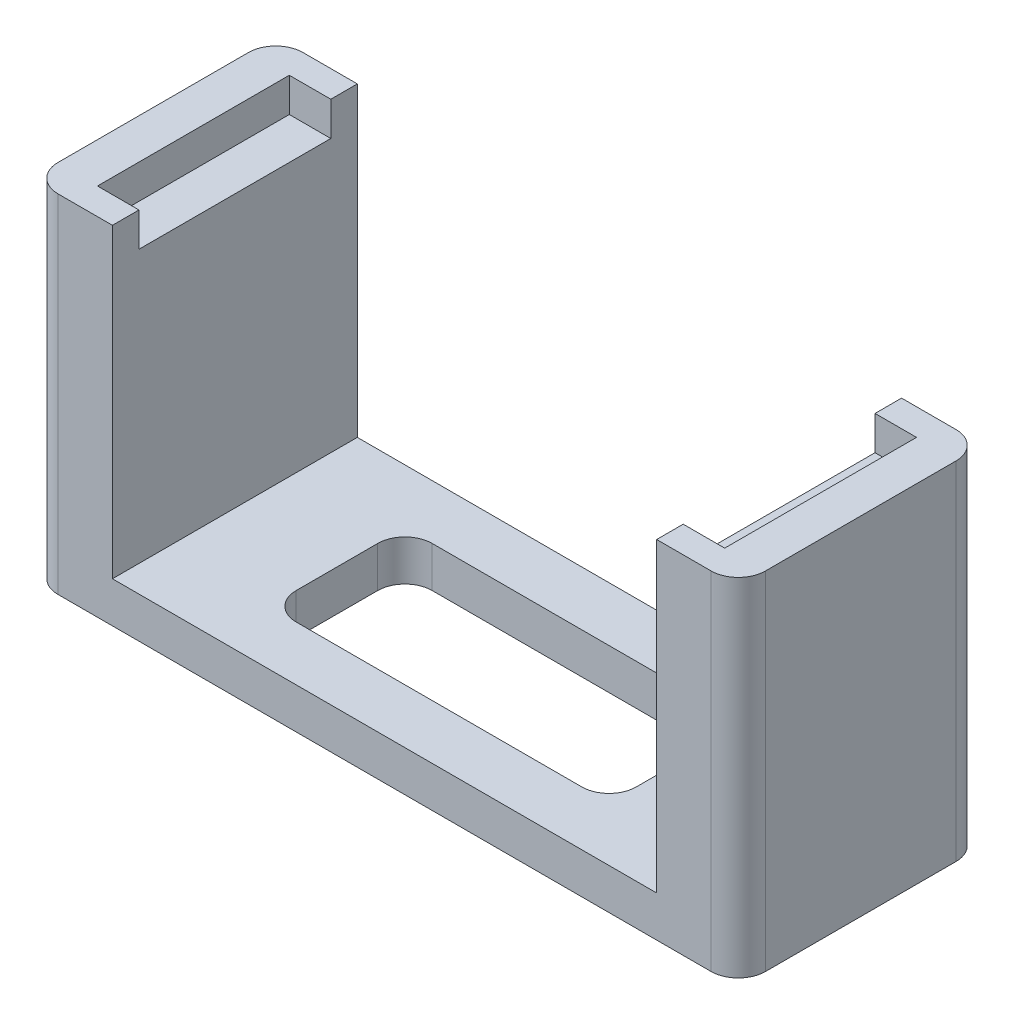
ISO-10303-21;
HEADER;
FILE_DESCRIPTION(('STEP AP214'),'2;1');
FILE_NAME('part.step','',(''),(''),'','','');
FILE_SCHEMA(('AUTOMOTIVE_DESIGN { 1 0 10303 214 1 1 1 1 }'));
ENDSEC;
DATA;
#1=APPLICATION_CONTEXT('core data for automotive mechanical design processes');
#2=APPLICATION_PROTOCOL_DEFINITION('international standard','automotive_design',2000,#1);
#3=PRODUCT_CONTEXT('',#1,'mechanical');
#4=PRODUCT('Part','Part','',(#3));
#5=PRODUCT_RELATED_PRODUCT_CATEGORY('part','',(#4));
#6=PRODUCT_DEFINITION_FORMATION('','',#4);
#7=PRODUCT_DEFINITION_CONTEXT('part definition',#1,'design');
#8=PRODUCT_DEFINITION('design','',#6,#7);
#9=PRODUCT_DEFINITION_SHAPE('','',#8);
#10=(LENGTH_UNIT() NAMED_UNIT(*) SI_UNIT(.MILLI.,.METRE.));
#11=(NAMED_UNIT(*) PLANE_ANGLE_UNIT() SI_UNIT($,.RADIAN.));
#12=(NAMED_UNIT(*) SI_UNIT($,.STERADIAN.) SOLID_ANGLE_UNIT());
#13=UNCERTAINTY_MEASURE_WITH_UNIT(LENGTH_MEASURE(1.E-05),#10,'distance_accuracy_value','');
#14=(GEOMETRIC_REPRESENTATION_CONTEXT(3) GLOBAL_UNCERTAINTY_ASSIGNED_CONTEXT((#13)) GLOBAL_UNIT_ASSIGNED_CONTEXT((#10,
#11,#12)) REPRESENTATION_CONTEXT('',''));
#15=CARTESIAN_POINT('',(0.,0.,0.));
#16=DIRECTION('',(0.,0.,1.));
#17=DIRECTION('',(1.,0.,0.));
#18=AXIS2_PLACEMENT_3D('',#15,#16,#17);
#19=CARTESIAN_POINT('',(0.,25.5,0.));
#20=DIRECTION('',(0.,1.,0.));
#21=DIRECTION('',(0.,0.,1.));
#22=AXIS2_PLACEMENT_3D('',#19,#20,#21);
#23=PLANE('',#22);
#24=DIRECTION('',(0.,0.,1.));
#25=VECTOR('',#24,1.);
#26=CARTESIAN_POINT('',(-26.,25.5,-9.));
#27=LINE('',#26,#25);
#28=CARTESIAN_POINT('',(-26.,25.5,-7.));
#29=VERTEX_POINT('',#28);
#30=CARTESIAN_POINT('',(-26.,25.5,7.));
#31=VERTEX_POINT('',#30);
#32=EDGE_CURVE('E339',#29,#31,#27,.T.);
#33=ORIENTED_EDGE('',*,*,#32,.T.);
#34=CARTESIAN_POINT('',(-24.,25.5,7.));
#35=DIRECTION('',(0.,1.,0.));
#36=DIRECTION('',(0.,0.,1.));
#37=AXIS2_PLACEMENT_3D('',#34,#35,#36);
#38=CIRCLE('',#37,2.);
#39=CARTESIAN_POINT('',(-24.,25.5,9.));
#40=VERTEX_POINT('',#39);
#41=EDGE_CURVE('E236',#31,#40,#38,.T.);
#42=ORIENTED_EDGE('',*,*,#41,.T.);
#43=DIRECTION('',(1.,0.,0.));
#44=VECTOR('',#43,1.);
#45=CARTESIAN_POINT('',(-26.,25.5,9.));
#46=LINE('',#45,#44);
#47=CARTESIAN_POINT('',(-20.,25.5,9.));
#48=VERTEX_POINT('',#47);
#49=EDGE_CURVE('E229',#40,#48,#46,.T.);
#50=ORIENTED_EDGE('',*,*,#49,.T.);
#51=DIRECTION('',(0.,0.,1.));
#52=VECTOR('',#51,1.);
#53=CARTESIAN_POINT('',(-20.,25.5,-9.));
#54=LINE('',#53,#52);
#55=CARTESIAN_POINT('',(-20.,25.5,7.05));
#56=VERTEX_POINT('',#55);
#57=EDGE_CURVE('E233',#56,#48,#54,.T.);
#58=ORIENTED_EDGE('',*,*,#57,.F.);
#59=DIRECTION('',(1.,0.,0.));
#60=VECTOR('',#59,1.);
#61=CARTESIAN_POINT('',(-23.05,25.5,7.05));
#62=LINE('',#61,#60);
#63=CARTESIAN_POINT('',(-23.05,25.5,7.05));
#64=VERTEX_POINT('',#63);
#65=EDGE_CURVE('E313',#64,#56,#62,.T.);
#66=ORIENTED_EDGE('',*,*,#65,.F.);
#67=DIRECTION('',(0.,0.,1.));
#68=VECTOR('',#67,1.);
#69=CARTESIAN_POINT('',(-23.05,25.5,-7.05));
#70=LINE('',#69,#68);
#71=CARTESIAN_POINT('',(-23.05,25.5,-7.05));
#72=VERTEX_POINT('',#71);
#73=EDGE_CURVE('E289',#72,#64,#70,.T.);
#74=ORIENTED_EDGE('',*,*,#73,.F.);
#75=DIRECTION('',(-1.,0.,0.));
#76=VECTOR('',#75,1.);
#77=CARTESIAN_POINT('',(-23.05,25.5,-7.05));
#78=LINE('',#77,#76);
#79=CARTESIAN_POINT('',(-20.,25.5,-7.05));
#80=VERTEX_POINT('',#79);
#81=EDGE_CURVE('E320',#80,#72,#78,.T.);
#82=ORIENTED_EDGE('',*,*,#81,.F.);
#83=CARTESIAN_POINT('',(-20.,25.5,-9.));
#84=VERTEX_POINT('',#83);
#85=EDGE_CURVE('E253',#84,#80,#54,.T.);
#86=ORIENTED_EDGE('',*,*,#85,.F.);
#87=DIRECTION('',(-1.,0.,0.));
#88=VECTOR('',#87,1.);
#89=CARTESIAN_POINT('',(-26.,25.5,-9.));
#90=LINE('',#89,#88);
#91=CARTESIAN_POINT('',(-24.,25.5,-9.));
#92=VERTEX_POINT('',#91);
#93=EDGE_CURVE('E346',#84,#92,#90,.T.);
#94=ORIENTED_EDGE('',*,*,#93,.T.);
#95=CARTESIAN_POINT('',(-24.,25.5,-7.));
#96=DIRECTION('',(0.,1.,0.));
#97=DIRECTION('',(0.,0.,1.));
#98=AXIS2_PLACEMENT_3D('',#95,#96,#97);
#99=CIRCLE('',#98,2.);
#100=EDGE_CURVE('E395',#92,#29,#99,.T.);
#101=ORIENTED_EDGE('',*,*,#100,.T.);
#102=EDGE_LOOP('',(#33,#42,#50,#58,#66,#74,#82,#86,#94,#101));
#103=FACE_BOUND('',#102,.T.);
#104=ADVANCED_FACE('F43',(#103),#23,.T.);
#105=CARTESIAN_POINT('',(-23.05,23.,-7.05));
#106=DIRECTION('',(0.,0.,-1.));
#107=DIRECTION('',(-1.,0.,0.));
#108=AXIS2_PLACEMENT_3D('',#105,#106,#107);
#109=PLANE('',#108);
#110=DIRECTION('',(-1.,0.,0.));
#111=VECTOR('',#110,1.);
#112=CARTESIAN_POINT('',(-23.05,23.,-7.05));
#113=LINE('',#112,#111);
#114=CARTESIAN_POINT('',(-20.,23.,-7.05));
#115=VERTEX_POINT('',#114);
#116=CARTESIAN_POINT('',(-23.05,23.,-7.05));
#117=VERTEX_POINT('',#116);
#118=EDGE_CURVE('E304',#115,#117,#113,.T.);
#119=ORIENTED_EDGE('',*,*,#118,.F.);
#120=DIRECTION('',(0.,1.,0.));
#121=VECTOR('',#120,1.);
#122=CARTESIAN_POINT('',(-20.,23.,-7.05));
#123=LINE('',#122,#121);
#124=EDGE_CURVE('E285',#115,#80,#123,.T.);
#125=ORIENTED_EDGE('',*,*,#124,.T.);
#126=ORIENTED_EDGE('',*,*,#81,.T.);
#127=DIRECTION('',(0.,1.,0.));
#128=VECTOR('',#127,1.);
#129=CARTESIAN_POINT('',(-23.05,23.,-7.05));
#130=LINE('',#129,#128);
#131=EDGE_CURVE('E324',#117,#72,#130,.T.);
#132=ORIENTED_EDGE('',*,*,#131,.F.);
#133=EDGE_LOOP('',(#119,#125,#126,#132));
#134=FACE_BOUND('',#133,.T.);
#135=ADVANCED_FACE('F595',(#134),#109,.F.);
#136=CARTESIAN_POINT('',(-23.05,23.,7.05));
#137=DIRECTION('',(0.,0.,1.));
#138=DIRECTION('',(1.,0.,0.));
#139=AXIS2_PLACEMENT_3D('',#136,#137,#138);
#140=PLANE('',#139);
#141=ORIENTED_EDGE('',*,*,#65,.T.);
#142=DIRECTION('',(0.,-1.,0.));
#143=VECTOR('',#142,1.);
#144=CARTESIAN_POINT('',(-20.,23.,7.05));
#145=LINE('',#144,#143);
#146=CARTESIAN_POINT('',(-20.,23.,7.05));
#147=VERTEX_POINT('',#146);
#148=EDGE_CURVE('E251',#56,#147,#145,.T.);
#149=ORIENTED_EDGE('',*,*,#148,.T.);
#150=DIRECTION('',(1.,0.,0.));
#151=VECTOR('',#150,1.);
#152=CARTESIAN_POINT('',(-23.05,23.,7.05));
#153=LINE('',#152,#151);
#154=CARTESIAN_POINT('',(-23.05,23.,7.05));
#155=VERTEX_POINT('',#154);
#156=EDGE_CURVE('E296',#155,#147,#153,.T.);
#157=ORIENTED_EDGE('',*,*,#156,.F.);
#158=DIRECTION('',(0.,1.,0.));
#159=VECTOR('',#158,1.);
#160=CARTESIAN_POINT('',(-23.05,23.,7.05));
#161=LINE('',#160,#159);
#162=EDGE_CURVE('E309',#155,#64,#161,.T.);
#163=ORIENTED_EDGE('',*,*,#162,.T.);
#164=EDGE_LOOP('',(#141,#149,#157,#163));
#165=FACE_BOUND('',#164,.T.);
#166=ADVANCED_FACE('F600',(#165),#140,.F.);
#167=CARTESIAN_POINT('',(0.,23.,0.));
#168=DIRECTION('',(0.,1.,0.));
#169=DIRECTION('',(0.,0.,1.));
#170=AXIS2_PLACEMENT_3D('',#167,#168,#169);
#171=PLANE('',#170);
#172=DIRECTION('',(0.,0.,1.));
#173=VECTOR('',#172,1.);
#174=CARTESIAN_POINT('',(-20.,23.,0.));
#175=LINE('',#174,#173);
#176=EDGE_CURVE('E367',#115,#147,#175,.T.);
#177=ORIENTED_EDGE('',*,*,#176,.F.);
#178=ORIENTED_EDGE('',*,*,#118,.T.);
#179=DIRECTION('',(0.,0.,1.));
#180=VECTOR('',#179,1.);
#181=CARTESIAN_POINT('',(-23.05,23.,-7.05));
#182=LINE('',#181,#180);
#183=EDGE_CURVE('E290',#117,#155,#182,.T.);
#184=ORIENTED_EDGE('',*,*,#183,.T.);
#185=ORIENTED_EDGE('',*,*,#156,.T.);
#186=EDGE_LOOP('',(#177,#178,#184,#185));
#187=FACE_BOUND('',#186,.T.);
#188=ADVANCED_FACE('F620',(#187),#171,.T.);
#189=CARTESIAN_POINT('',(-26.,25.5,-9.));
#190=DIRECTION('',(1.,0.,0.));
#191=DIRECTION('',(0.,0.,-1.));
#192=AXIS2_PLACEMENT_3D('',#189,#190,#191);
#193=PLANE('',#192);
#194=DIRECTION('',(0.,0.,1.));
#195=VECTOR('',#194,1.);
#196=CARTESIAN_POINT('',(-26.,0.,-9.));
#197=LINE('',#196,#195);
#198=CARTESIAN_POINT('',(-26.,0.,-7.));
#199=VERTEX_POINT('',#198);
#200=CARTESIAN_POINT('',(-26.,0.,7.));
#201=VERTEX_POINT('',#200);
#202=EDGE_CURVE('E328',#199,#201,#197,.T.);
#203=ORIENTED_EDGE('',*,*,#202,.T.);
#204=DIRECTION('',(0.,-1.,0.));
#205=VECTOR('',#204,1.);
#206=CARTESIAN_POINT('',(-26.,25.5,7.));
#207=LINE('',#206,#205);
#208=EDGE_CURVE('E392',#201,#31,#207,.F.);
#209=ORIENTED_EDGE('',*,*,#208,.T.);
#210=ORIENTED_EDGE('',*,*,#32,.F.);
#211=DIRECTION('',(0.,-1.,0.));
#212=VECTOR('',#211,1.);
#213=CARTESIAN_POINT('',(-26.,25.5,-7.));
#214=LINE('',#213,#212);
#215=EDGE_CURVE('E388',#29,#199,#214,.T.);
#216=ORIENTED_EDGE('',*,*,#215,.T.);
#217=EDGE_LOOP('',(#203,#209,#210,#216));
#218=FACE_BOUND('',#217,.T.);
#219=ADVANCED_FACE('F564',(#218),#193,.F.);
#220=CARTESIAN_POINT('',(-26.,25.5,9.));
#221=DIRECTION('',(0.,0.,-1.));
#222=DIRECTION('',(-1.,0.,0.));
#223=AXIS2_PLACEMENT_3D('',#220,#221,#222);
#224=PLANE('',#223);
#225=ORIENTED_EDGE('',*,*,#49,.F.);
#226=DIRECTION('',(0.,-1.,0.));
#227=VECTOR('',#226,1.);
#228=CARTESIAN_POINT('',(-24.,25.5,9.));
#229=LINE('',#228,#227);
#230=CARTESIAN_POINT('',(-24.,0.,9.));
#231=VERTEX_POINT('',#230);
#232=EDGE_CURVE('E373',#40,#231,#229,.T.);
#233=ORIENTED_EDGE('',*,*,#232,.T.);
#234=DIRECTION('',(1.,0.,0.));
#235=VECTOR('',#234,1.);
#236=CARTESIAN_POINT('',(-26.,0.,9.));
#237=LINE('',#236,#235);
#238=CARTESIAN_POINT('',(24.,0.,9.));
#239=VERTEX_POINT('',#238);
#240=EDGE_CURVE('E354',#231,#239,#237,.T.);
#241=ORIENTED_EDGE('',*,*,#240,.T.);
#242=DIRECTION('',(0.,-1.,0.));
#243=VECTOR('',#242,1.);
#244=CARTESIAN_POINT('',(24.,25.5,9.));
#245=LINE('',#244,#243);
#246=CARTESIAN_POINT('',(24.,25.5,9.));
#247=VERTEX_POINT('',#246);
#248=EDGE_CURVE('E370',#239,#247,#245,.F.);
#249=ORIENTED_EDGE('',*,*,#248,.T.);
#250=CARTESIAN_POINT('',(20.,25.5,9.));
#251=VERTEX_POINT('',#250);
#252=EDGE_CURVE('E243',#251,#247,#46,.T.);
#253=ORIENTED_EDGE('',*,*,#252,.F.);
#254=DIRECTION('',(0.,1.,0.));
#255=VECTOR('',#254,1.);
#256=CARTESIAN_POINT('',(20.,-43.8634243989226,9.));
#257=LINE('',#256,#255);
#258=CARTESIAN_POINT('',(20.,3.,9.));
#259=VERTEX_POINT('',#258);
#260=EDGE_CURVE('E261',#259,#251,#257,.T.);
#261=ORIENTED_EDGE('',*,*,#260,.F.);
#262=DIRECTION('',(-1.,0.,0.));
#263=VECTOR('',#262,1.);
#264=CARTESIAN_POINT('',(-20.,3.,9.));
#265=LINE('',#264,#263);
#266=CARTESIAN_POINT('',(-20.,3.,9.));
#267=VERTEX_POINT('',#266);
#268=EDGE_CURVE('E259',#259,#267,#265,.T.);
#269=ORIENTED_EDGE('',*,*,#268,.T.);
#270=DIRECTION('',(0.,1.,0.));
#271=VECTOR('',#270,1.);
#272=CARTESIAN_POINT('',(-20.,-43.8634243989226,9.));
#273=LINE('',#272,#271);
#274=EDGE_CURVE('E248',#267,#48,#273,.T.);
#275=ORIENTED_EDGE('',*,*,#274,.T.);
#276=EDGE_LOOP('',(#225,#233,#241,#249,#253,#261,#269,#275));
#277=FACE_BOUND('',#276,.T.);
#278=ADVANCED_FACE('F256',(#277),#224,.F.);
#279=CARTESIAN_POINT('',(26.,25.5,-9.));
#280=DIRECTION('',(-1.,0.,0.));
#281=DIRECTION('',(0.,0.,1.));
#282=AXIS2_PLACEMENT_3D('',#279,#280,#281);
#283=PLANE('',#282);
#284=DIRECTION('',(0.,0.,-1.));
#285=VECTOR('',#284,1.);
#286=CARTESIAN_POINT('',(26.,0.,-9.));
#287=LINE('',#286,#285);
#288=CARTESIAN_POINT('',(26.,0.,7.));
#289=VERTEX_POINT('',#288);
#290=CARTESIAN_POINT('',(26.,0.,-7.));
#291=VERTEX_POINT('',#290);
#292=EDGE_CURVE('E358',#289,#291,#287,.T.);
#293=ORIENTED_EDGE('',*,*,#292,.T.);
#294=DIRECTION('',(0.,-1.,0.));
#295=VECTOR('',#294,1.);
#296=CARTESIAN_POINT('',(26.,25.5,-7.));
#297=LINE('',#296,#295);
#298=CARTESIAN_POINT('',(26.,25.5,-7.));
#299=VERTEX_POINT('',#298);
#300=EDGE_CURVE('E411',#291,#299,#297,.F.);
#301=ORIENTED_EDGE('',*,*,#300,.T.);
#302=DIRECTION('',(0.,0.,-1.));
#303=VECTOR('',#302,1.);
#304=CARTESIAN_POINT('',(26.,25.5,-9.));
#305=LINE('',#304,#303);
#306=CARTESIAN_POINT('',(26.,25.5,7.));
#307=VERTEX_POINT('',#306);
#308=EDGE_CURVE('E242',#307,#299,#305,.T.);
#309=ORIENTED_EDGE('',*,*,#308,.F.);
#310=DIRECTION('',(0.,-1.,0.));
#311=VECTOR('',#310,1.);
#312=CARTESIAN_POINT('',(26.,25.5,7.));
#313=LINE('',#312,#311);
#314=EDGE_CURVE('E407',#307,#289,#313,.T.);
#315=ORIENTED_EDGE('',*,*,#314,.T.);
#316=EDGE_LOOP('',(#293,#301,#309,#315));
#317=FACE_BOUND('',#316,.T.);
#318=ADVANCED_FACE('F580',(#317),#283,.F.);
#319=CARTESIAN_POINT('',(-26.,25.5,-9.));
#320=DIRECTION('',(0.,0.,1.));
#321=DIRECTION('',(1.,0.,0.));
#322=AXIS2_PLACEMENT_3D('',#319,#320,#321);
#323=PLANE('',#322);
#324=CARTESIAN_POINT('',(24.,25.5,-9.));
#325=VERTEX_POINT('',#324);
#326=CARTESIAN_POINT('',(20.,25.5,-9.));
#327=VERTEX_POINT('',#326);
#328=EDGE_CURVE('E347',#325,#327,#90,.T.);
#329=ORIENTED_EDGE('',*,*,#328,.F.);
#330=DIRECTION('',(0.,-1.,0.));
#331=VECTOR('',#330,1.);
#332=CARTESIAN_POINT('',(24.,25.5,-9.));
#333=LINE('',#332,#331);
#334=CARTESIAN_POINT('',(24.,0.,-9.));
#335=VERTEX_POINT('',#334);
#336=EDGE_CURVE('E403',#325,#335,#333,.T.);
#337=ORIENTED_EDGE('',*,*,#336,.T.);
#338=DIRECTION('',(-1.,0.,0.));
#339=VECTOR('',#338,1.);
#340=CARTESIAN_POINT('',(-26.,0.,-9.));
#341=LINE('',#340,#339);
#342=CARTESIAN_POINT('',(-24.,0.,-9.));
#343=VERTEX_POINT('',#342);
#344=EDGE_CURVE('E341',#335,#343,#341,.T.);
#345=ORIENTED_EDGE('',*,*,#344,.T.);
#346=DIRECTION('',(0.,-1.,0.));
#347=VECTOR('',#346,1.);
#348=CARTESIAN_POINT('',(-24.,25.5,-9.));
#349=LINE('',#348,#347);
#350=EDGE_CURVE('E400',#343,#92,#349,.F.);
#351=ORIENTED_EDGE('',*,*,#350,.T.);
#352=ORIENTED_EDGE('',*,*,#93,.F.);
#353=DIRECTION('',(0.,1.,0.));
#354=VECTOR('',#353,1.);
#355=CARTESIAN_POINT('',(-20.,-43.8634243989226,-9.));
#356=LINE('',#355,#354);
#357=CARTESIAN_POINT('',(-20.,3.,-9.));
#358=VERTEX_POINT('',#357);
#359=EDGE_CURVE('E508',#358,#84,#356,.T.);
#360=ORIENTED_EDGE('',*,*,#359,.F.);
#361=DIRECTION('',(1.,0.,0.));
#362=VECTOR('',#361,1.);
#363=CARTESIAN_POINT('',(-20.,3.,-9.));
#364=LINE('',#363,#362);
#365=CARTESIAN_POINT('',(20.,3.,-9.));
#366=VERTEX_POINT('',#365);
#367=EDGE_CURVE('E507',#358,#366,#364,.T.);
#368=ORIENTED_EDGE('',*,*,#367,.T.);
#369=DIRECTION('',(0.,1.,0.));
#370=VECTOR('',#369,1.);
#371=CARTESIAN_POINT('',(20.,-43.8634243989226,-9.));
#372=LINE('',#371,#370);
#373=EDGE_CURVE('E266',#366,#327,#372,.T.);
#374=ORIENTED_EDGE('',*,*,#373,.T.);
#375=EDGE_LOOP('',(#329,#337,#345,#351,#352,#360,#368,#374));
#376=FACE_BOUND('',#375,.T.);
#377=ADVANCED_FACE('F521',(#376),#323,.F.);
#378=ORIENTED_EDGE('',*,*,#308,.T.);
#379=CARTESIAN_POINT('',(24.,25.5,-7.));
#380=DIRECTION('',(0.,1.,0.));
#381=DIRECTION('',(0.,0.,1.));
#382=AXIS2_PLACEMENT_3D('',#379,#380,#381);
#383=CIRCLE('',#382,2.);
#384=EDGE_CURVE('E417',#299,#325,#383,.T.);
#385=ORIENTED_EDGE('',*,*,#384,.T.);
#386=ORIENTED_EDGE('',*,*,#328,.T.);
#387=DIRECTION('',(0.,0.,-1.));
#388=VECTOR('',#387,1.);
#389=CARTESIAN_POINT('',(20.,25.5,-9.));
#390=LINE('',#389,#388);
#391=CARTESIAN_POINT('',(20.,25.5,-7.05));
#392=VERTEX_POINT('',#391);
#393=EDGE_CURVE('E268',#392,#327,#390,.T.);
#394=ORIENTED_EDGE('',*,*,#393,.F.);
#395=CARTESIAN_POINT('',(23.05,25.5,-7.05));
#396=VERTEX_POINT('',#395);
#397=EDGE_CURVE('E295',#396,#392,#78,.T.);
#398=ORIENTED_EDGE('',*,*,#397,.F.);
#399=DIRECTION('',(0.,0.,-1.));
#400=VECTOR('',#399,1.);
#401=CARTESIAN_POINT('',(23.05,25.5,-7.05));
#402=LINE('',#401,#400);
#403=CARTESIAN_POINT('',(23.05,25.5,7.05));
#404=VERTEX_POINT('',#403);
#405=EDGE_CURVE('E316',#404,#396,#402,.T.);
#406=ORIENTED_EDGE('',*,*,#405,.F.);
#407=CARTESIAN_POINT('',(20.,25.5,7.05));
#408=VERTEX_POINT('',#407);
#409=EDGE_CURVE('E312',#408,#404,#62,.T.);
#410=ORIENTED_EDGE('',*,*,#409,.F.);
#411=EDGE_CURVE('E262',#251,#408,#390,.T.);
#412=ORIENTED_EDGE('',*,*,#411,.F.);
#413=ORIENTED_EDGE('',*,*,#252,.T.);
#414=CARTESIAN_POINT('',(24.,25.5,7.));
#415=DIRECTION('',(0.,1.,0.));
#416=DIRECTION('',(0.,0.,1.));
#417=AXIS2_PLACEMENT_3D('',#414,#415,#416);
#418=CIRCLE('',#417,2.);
#419=EDGE_CURVE('E414',#247,#307,#418,.T.);
#420=ORIENTED_EDGE('',*,*,#419,.T.);
#421=EDGE_LOOP('',(#378,#385,#386,#394,#398,#406,#410,#412,#413,#420));
#422=FACE_BOUND('',#421,.T.);
#423=ADVANCED_FACE('F532',(#422),#23,.T.);
#424=CARTESIAN_POINT('',(0.,0.,0.));
#425=DIRECTION('',(0.,1.,0.));
#426=DIRECTION('',(0.,0.,1.));
#427=AXIS2_PLACEMENT_3D('',#424,#425,#426);
#428=PLANE('',#427);
#429=DIRECTION('',(0.,0.,-1.));
#430=VECTOR('',#429,1.);
#431=CARTESIAN_POINT('',(12.5,0.,-5.));
#432=LINE('',#431,#430);
#433=CARTESIAN_POINT('',(12.5,0.,3.));
#434=VERTEX_POINT('',#433);
#435=CARTESIAN_POINT('',(12.5,0.,-3.));
#436=VERTEX_POINT('',#435);
#437=EDGE_CURVE('E487',#434,#436,#432,.T.);
#438=ORIENTED_EDGE('',*,*,#437,.T.);
#439=CARTESIAN_POINT('',(10.5,0.,-3.));
#440=DIRECTION('',(0.,1.,0.));
#441=DIRECTION('',(0.,0.,1.));
#442=AXIS2_PLACEMENT_3D('',#439,#440,#441);
#443=CIRCLE('',#442,2.);
#444=CARTESIAN_POINT('',(10.5,0.,-5.));
#445=VERTEX_POINT('',#444);
#446=EDGE_CURVE('E12',#436,#445,#443,.T.);
#447=ORIENTED_EDGE('',*,*,#446,.T.);
#448=DIRECTION('',(-1.,0.,0.));
#449=VECTOR('',#448,1.);
#450=CARTESIAN_POINT('',(-12.5,0.,-5.));
#451=LINE('',#450,#449);
#452=CARTESIAN_POINT('',(-10.5,0.,-5.));
#453=VERTEX_POINT('',#452);
#454=EDGE_CURVE('E254',#445,#453,#451,.T.);
#455=ORIENTED_EDGE('',*,*,#454,.T.);
#456=CARTESIAN_POINT('',(-10.5,0.,-3.));
#457=DIRECTION('',(0.,1.,0.));
#458=DIRECTION('',(0.,0.,1.));
#459=AXIS2_PLACEMENT_3D('',#456,#457,#458);
#460=CIRCLE('',#459,2.);
#461=CARTESIAN_POINT('',(-12.5,0.,-3.));
#462=VERTEX_POINT('',#461);
#463=EDGE_CURVE('E462',#453,#462,#460,.T.);
#464=ORIENTED_EDGE('',*,*,#463,.T.);
#465=DIRECTION('',(0.,0.,1.));
#466=VECTOR('',#465,1.);
#467=CARTESIAN_POINT('',(-12.5,0.,-5.));
#468=LINE('',#467,#466);
#469=CARTESIAN_POINT('',(-12.5,0.,3.));
#470=VERTEX_POINT('',#469);
#471=EDGE_CURVE('E503',#462,#470,#468,.T.);
#472=ORIENTED_EDGE('',*,*,#471,.T.);
#473=CARTESIAN_POINT('',(-10.5,0.,3.));
#474=DIRECTION('',(0.,1.,0.));
#475=DIRECTION('',(0.,0.,1.));
#476=AXIS2_PLACEMENT_3D('',#473,#474,#475);
#477=CIRCLE('',#476,2.);
#478=CARTESIAN_POINT('',(-10.5,0.,5.));
#479=VERTEX_POINT('',#478);
#480=EDGE_CURVE('E456',#470,#479,#477,.T.);
#481=ORIENTED_EDGE('',*,*,#480,.T.);
#482=DIRECTION('',(1.,0.,0.));
#483=VECTOR('',#482,1.);
#484=CARTESIAN_POINT('',(-12.5,0.,5.));
#485=LINE('',#484,#483);
#486=CARTESIAN_POINT('',(10.5,0.,5.));
#487=VERTEX_POINT('',#486);
#488=EDGE_CURVE('E490',#479,#487,#485,.T.);
#489=ORIENTED_EDGE('',*,*,#488,.T.);
#490=CARTESIAN_POINT('',(10.5,0.,3.));
#491=DIRECTION('',(0.,1.,0.));
#492=DIRECTION('',(0.,0.,1.));
#493=AXIS2_PLACEMENT_3D('',#490,#491,#492);
#494=CIRCLE('',#493,2.);
#495=EDGE_CURVE('E450',#487,#434,#494,.T.);
#496=ORIENTED_EDGE('',*,*,#495,.T.);
#497=EDGE_LOOP('',(#438,#447,#455,#464,#472,#481,#489,#496));
#498=FACE_BOUND('',#497,.T.);
#499=ORIENTED_EDGE('',*,*,#240,.F.);
#500=CARTESIAN_POINT('',(-24.,0.,7.));
#501=DIRECTION('',(0.,1.,0.));
#502=DIRECTION('',(0.,0.,1.));
#503=AXIS2_PLACEMENT_3D('',#500,#501,#502);
#504=CIRCLE('',#503,2.);
#505=EDGE_CURVE('E385',#231,#201,#504,.F.);
#506=ORIENTED_EDGE('',*,*,#505,.T.);
#507=ORIENTED_EDGE('',*,*,#202,.F.);
#508=CARTESIAN_POINT('',(-24.,0.,-7.));
#509=DIRECTION('',(0.,1.,0.));
#510=DIRECTION('',(0.,0.,1.));
#511=AXIS2_PLACEMENT_3D('',#508,#509,#510);
#512=CIRCLE('',#511,2.);
#513=EDGE_CURVE('E379',#199,#343,#512,.F.);
#514=ORIENTED_EDGE('',*,*,#513,.T.);
#515=ORIENTED_EDGE('',*,*,#344,.F.);
#516=CARTESIAN_POINT('',(24.,0.,-7.));
#517=DIRECTION('',(0.,1.,0.));
#518=DIRECTION('',(0.,0.,1.));
#519=AXIS2_PLACEMENT_3D('',#516,#517,#518);
#520=CIRCLE('',#519,2.);
#521=EDGE_CURVE('E382',#335,#291,#520,.F.);
#522=ORIENTED_EDGE('',*,*,#521,.T.);
#523=ORIENTED_EDGE('',*,*,#292,.F.);
#524=CARTESIAN_POINT('',(24.,0.,7.));
#525=DIRECTION('',(0.,1.,0.));
#526=DIRECTION('',(0.,0.,1.));
#527=AXIS2_PLACEMENT_3D('',#524,#525,#526);
#528=CIRCLE('',#527,2.);
#529=EDGE_CURVE('E376',#289,#239,#528,.F.);
#530=ORIENTED_EDGE('',*,*,#529,.T.);
#531=EDGE_LOOP('',(#499,#506,#507,#514,#515,#522,#523,#530));
#532=FACE_BOUND('',#531,.T.);
#533=ADVANCED_FACE('F568',(#498,#532),#428,.F.);
#534=CARTESIAN_POINT('',(-23.05,23.,-7.05));
#535=DIRECTION('',(-1.,0.,0.));
#536=DIRECTION('',(0.,0.,1.));
#537=AXIS2_PLACEMENT_3D('',#534,#535,#536);
#538=PLANE('',#537);
#539=ORIENTED_EDGE('',*,*,#73,.T.);
#540=ORIENTED_EDGE('',*,*,#162,.F.);
#541=ORIENTED_EDGE('',*,*,#183,.F.);
#542=ORIENTED_EDGE('',*,*,#131,.T.);
#543=EDGE_LOOP('',(#539,#540,#541,#542));
#544=FACE_BOUND('',#543,.T.);
#545=ADVANCED_FACE('F610',(#544),#538,.F.);
#546=ORIENTED_EDGE('',*,*,#397,.T.);
#547=DIRECTION('',(0.,-1.,0.));
#548=VECTOR('',#547,1.);
#549=CARTESIAN_POINT('',(20.,23.,-7.05));
#550=LINE('',#549,#548);
#551=CARTESIAN_POINT('',(20.,23.,-7.05));
#552=VERTEX_POINT('',#551);
#553=EDGE_CURVE('E279',#392,#552,#550,.T.);
#554=ORIENTED_EDGE('',*,*,#553,.T.);
#555=CARTESIAN_POINT('',(23.05,23.,-7.05));
#556=VERTEX_POINT('',#555);
#557=EDGE_CURVE('E305',#556,#552,#113,.T.);
#558=ORIENTED_EDGE('',*,*,#557,.F.);
#559=DIRECTION('',(0.,1.,0.));
#560=VECTOR('',#559,1.);
#561=CARTESIAN_POINT('',(23.05,23.,-7.05));
#562=LINE('',#561,#560);
#563=EDGE_CURVE('E329',#556,#396,#562,.T.);
#564=ORIENTED_EDGE('',*,*,#563,.T.);
#565=EDGE_LOOP('',(#546,#554,#558,#564));
#566=FACE_BOUND('',#565,.T.);
#567=ADVANCED_FACE('F535',(#566),#109,.F.);
#568=CARTESIAN_POINT('',(23.05,23.,-7.05));
#569=DIRECTION('',(1.,0.,0.));
#570=DIRECTION('',(0.,0.,-1.));
#571=AXIS2_PLACEMENT_3D('',#568,#569,#570);
#572=PLANE('',#571);
#573=ORIENTED_EDGE('',*,*,#405,.T.);
#574=ORIENTED_EDGE('',*,*,#563,.F.);
#575=DIRECTION('',(0.,0.,-1.));
#576=VECTOR('',#575,1.);
#577=CARTESIAN_POINT('',(23.05,23.,-7.05));
#578=LINE('',#577,#576);
#579=CARTESIAN_POINT('',(23.05,23.,7.05));
#580=VERTEX_POINT('',#579);
#581=EDGE_CURVE('E300',#580,#556,#578,.T.);
#582=ORIENTED_EDGE('',*,*,#581,.F.);
#583=DIRECTION('',(0.,1.,0.));
#584=VECTOR('',#583,1.);
#585=CARTESIAN_POINT('',(23.05,23.,7.05));
#586=LINE('',#585,#584);
#587=EDGE_CURVE('E332',#580,#404,#586,.T.);
#588=ORIENTED_EDGE('',*,*,#587,.T.);
#589=EDGE_LOOP('',(#573,#574,#582,#588));
#590=FACE_BOUND('',#589,.T.);
#591=ADVANCED_FACE('F539',(#590),#572,.F.);
#592=CARTESIAN_POINT('',(20.,23.,7.05));
#593=VERTEX_POINT('',#592);
#594=EDGE_CURVE('E294',#593,#580,#153,.T.);
#595=ORIENTED_EDGE('',*,*,#594,.F.);
#596=DIRECTION('',(0.,1.,0.));
#597=VECTOR('',#596,1.);
#598=CARTESIAN_POINT('',(20.,23.,7.05));
#599=LINE('',#598,#597);
#600=EDGE_CURVE('E274',#593,#408,#599,.T.);
#601=ORIENTED_EDGE('',*,*,#600,.T.);
#602=ORIENTED_EDGE('',*,*,#409,.T.);
#603=ORIENTED_EDGE('',*,*,#587,.F.);
#604=EDGE_LOOP('',(#595,#601,#602,#603));
#605=FACE_BOUND('',#604,.T.);
#606=ADVANCED_FACE('F632',(#605),#140,.F.);
#607=DIRECTION('',(0.,0.,-1.));
#608=VECTOR('',#607,1.);
#609=CARTESIAN_POINT('',(20.,23.,0.));
#610=LINE('',#609,#608);
#611=EDGE_CURVE('E350',#593,#552,#610,.T.);
#612=ORIENTED_EDGE('',*,*,#611,.F.);
#613=ORIENTED_EDGE('',*,*,#594,.T.);
#614=ORIENTED_EDGE('',*,*,#581,.T.);
#615=ORIENTED_EDGE('',*,*,#557,.T.);
#616=EDGE_LOOP('',(#612,#613,#614,#615));
#617=FACE_BOUND('',#616,.T.);
#618=ADVANCED_FACE('F626',(#617),#171,.T.);
#619=CARTESIAN_POINT('',(-20.,-43.8634243989226,-9.));
#620=DIRECTION('',(-1.,0.,0.));
#621=DIRECTION('',(0.,0.,1.));
#622=AXIS2_PLACEMENT_3D('',#619,#620,#621);
#623=PLANE('',#622);
#624=ORIENTED_EDGE('',*,*,#176,.T.);
#625=ORIENTED_EDGE('',*,*,#148,.F.);
#626=ORIENTED_EDGE('',*,*,#57,.T.);
#627=ORIENTED_EDGE('',*,*,#274,.F.);
#628=DIRECTION('',(0.,0.,-1.));
#629=VECTOR('',#628,1.);
#630=CARTESIAN_POINT('',(-20.,3.,-9.));
#631=LINE('',#630,#629);
#632=EDGE_CURVE('E275',#267,#358,#631,.T.);
#633=ORIENTED_EDGE('',*,*,#632,.T.);
#634=ORIENTED_EDGE('',*,*,#359,.T.);
#635=ORIENTED_EDGE('',*,*,#85,.T.);
#636=ORIENTED_EDGE('',*,*,#124,.F.);
#637=EDGE_LOOP('',(#624,#625,#626,#627,#633,#634,#635,#636));
#638=FACE_BOUND('',#637,.T.);
#639=ADVANCED_FACE('F247',(#638),#623,.F.);
#640=CARTESIAN_POINT('',(20.,-43.8634243989226,-9.));
#641=DIRECTION('',(1.,0.,0.));
#642=DIRECTION('',(0.,0.,-1.));
#643=AXIS2_PLACEMENT_3D('',#640,#641,#642);
#644=PLANE('',#643);
#645=ORIENTED_EDGE('',*,*,#393,.T.);
#646=ORIENTED_EDGE('',*,*,#373,.F.);
#647=DIRECTION('',(0.,0.,1.));
#648=VECTOR('',#647,1.);
#649=CARTESIAN_POINT('',(20.,3.,-9.));
#650=LINE('',#649,#648);
#651=EDGE_CURVE('E504',#366,#259,#650,.T.);
#652=ORIENTED_EDGE('',*,*,#651,.T.);
#653=ORIENTED_EDGE('',*,*,#260,.T.);
#654=ORIENTED_EDGE('',*,*,#411,.T.);
#655=ORIENTED_EDGE('',*,*,#600,.F.);
#656=ORIENTED_EDGE('',*,*,#611,.T.);
#657=ORIENTED_EDGE('',*,*,#553,.F.);
#658=EDGE_LOOP('',(#645,#646,#652,#653,#654,#655,#656,#657));
#659=FACE_BOUND('',#658,.T.);
#660=ADVANCED_FACE('F527',(#659),#644,.F.);
#661=CARTESIAN_POINT('',(0.,3.,0.));
#662=DIRECTION('',(0.,1.,0.));
#663=DIRECTION('',(0.,0.,1.));
#664=AXIS2_PLACEMENT_3D('',#661,#662,#663);
#665=PLANE('',#664);
#666=DIRECTION('',(0.,0.,1.));
#667=VECTOR('',#666,1.);
#668=CARTESIAN_POINT('',(-12.5,3.,-5.));
#669=LINE('',#668,#667);
#670=CARTESIAN_POINT('',(-12.5,3.,-3.));
#671=VERTEX_POINT('',#670);
#672=CARTESIAN_POINT('',(-12.5,3.,3.));
#673=VERTEX_POINT('',#672);
#674=EDGE_CURVE('E494',#671,#673,#669,.T.);
#675=ORIENTED_EDGE('',*,*,#674,.F.);
#676=CARTESIAN_POINT('',(-10.5,3.,-3.));
#677=DIRECTION('',(0.,1.,0.));
#678=DIRECTION('',(0.,0.,1.));
#679=AXIS2_PLACEMENT_3D('',#676,#677,#678);
#680=CIRCLE('',#679,2.);
#681=CARTESIAN_POINT('',(-10.5,3.,-5.));
#682=VERTEX_POINT('',#681);
#683=EDGE_CURVE('E459',#671,#682,#680,.F.);
#684=ORIENTED_EDGE('',*,*,#683,.T.);
#685=DIRECTION('',(-1.,0.,0.));
#686=VECTOR('',#685,1.);
#687=CARTESIAN_POINT('',(-12.5,3.,-5.));
#688=LINE('',#687,#686);
#689=CARTESIAN_POINT('',(10.5,3.,-5.));
#690=VERTEX_POINT('',#689);
#691=EDGE_CURVE('E473',#690,#682,#688,.T.);
#692=ORIENTED_EDGE('',*,*,#691,.F.);
#693=CARTESIAN_POINT('',(10.5,3.,-3.));
#694=DIRECTION('',(0.,1.,0.));
#695=DIRECTION('',(0.,0.,1.));
#696=AXIS2_PLACEMENT_3D('',#693,#694,#695);
#697=CIRCLE('',#696,2.);
#698=CARTESIAN_POINT('',(12.5,3.,-3.));
#699=VERTEX_POINT('',#698);
#700=EDGE_CURVE('E52',#690,#699,#697,.F.);
#701=ORIENTED_EDGE('',*,*,#700,.T.);
#702=DIRECTION('',(0.,0.,-1.));
#703=VECTOR('',#702,1.);
#704=CARTESIAN_POINT('',(12.5,3.,-5.));
#705=LINE('',#704,#703);
#706=CARTESIAN_POINT('',(12.5,3.,3.));
#707=VERTEX_POINT('',#706);
#708=EDGE_CURVE('E472',#707,#699,#705,.T.);
#709=ORIENTED_EDGE('',*,*,#708,.F.);
#710=CARTESIAN_POINT('',(10.5,3.,3.));
#711=DIRECTION('',(0.,1.,0.));
#712=DIRECTION('',(0.,0.,1.));
#713=AXIS2_PLACEMENT_3D('',#710,#711,#712);
#714=CIRCLE('',#713,2.);
#715=CARTESIAN_POINT('',(10.5,3.,5.));
#716=VERTEX_POINT('',#715);
#717=EDGE_CURVE('E447',#707,#716,#714,.F.);
#718=ORIENTED_EDGE('',*,*,#717,.T.);
#719=DIRECTION('',(1.,0.,0.));
#720=VECTOR('',#719,1.);
#721=CARTESIAN_POINT('',(-12.5,3.,5.));
#722=LINE('',#721,#720);
#723=CARTESIAN_POINT('',(-10.5,3.,5.));
#724=VERTEX_POINT('',#723);
#725=EDGE_CURVE('E482',#724,#716,#722,.T.);
#726=ORIENTED_EDGE('',*,*,#725,.F.);
#727=CARTESIAN_POINT('',(-10.5,3.,3.));
#728=DIRECTION('',(0.,1.,0.));
#729=DIRECTION('',(0.,0.,1.));
#730=AXIS2_PLACEMENT_3D('',#727,#728,#729);
#731=CIRCLE('',#730,2.);
#732=EDGE_CURVE('E453',#724,#673,#731,.F.);
#733=ORIENTED_EDGE('',*,*,#732,.T.);
#734=EDGE_LOOP('',(#675,#684,#692,#701,#709,#718,#726,#733));
#735=FACE_BOUND('',#734,.T.);
#736=ORIENTED_EDGE('',*,*,#632,.F.);
#737=ORIENTED_EDGE('',*,*,#268,.F.);
#738=ORIENTED_EDGE('',*,*,#651,.F.);
#739=ORIENTED_EDGE('',*,*,#367,.F.);
#740=EDGE_LOOP('',(#736,#737,#738,#739));
#741=FACE_BOUND('',#740,.T.);
#742=ADVANCED_FACE('F470',(#735,#741),#665,.T.);
#743=CARTESIAN_POINT('',(-12.5,0.,-5.));
#744=DIRECTION('',(-1.,0.,0.));
#745=DIRECTION('',(0.,0.,1.));
#746=AXIS2_PLACEMENT_3D('',#743,#744,#745);
#747=PLANE('',#746);
#748=ORIENTED_EDGE('',*,*,#674,.T.);
#749=DIRECTION('',(0.,1.,0.));
#750=VECTOR('',#749,1.);
#751=CARTESIAN_POINT('',(-12.5,0.,3.));
#752=LINE('',#751,#750);
#753=EDGE_CURVE('E438',#673,#470,#752,.F.);
#754=ORIENTED_EDGE('',*,*,#753,.T.);
#755=ORIENTED_EDGE('',*,*,#471,.F.);
#756=DIRECTION('',(0.,1.,0.));
#757=VECTOR('',#756,1.);
#758=CARTESIAN_POINT('',(-12.5,3.,-3.));
#759=LINE('',#758,#757);
#760=EDGE_CURVE('E434',#462,#671,#759,.T.);
#761=ORIENTED_EDGE('',*,*,#760,.T.);
#762=EDGE_LOOP('',(#748,#754,#755,#761));
#763=FACE_BOUND('',#762,.T.);
#764=ADVANCED_FACE('F658',(#763),#747,.F.);
#765=CARTESIAN_POINT('',(-12.5,0.,-5.));
#766=DIRECTION('',(0.,0.,-1.));
#767=DIRECTION('',(-1.,0.,0.));
#768=AXIS2_PLACEMENT_3D('',#765,#766,#767);
#769=PLANE('',#768);
#770=ORIENTED_EDGE('',*,*,#691,.T.);
#771=DIRECTION('',(0.,1.,0.));
#772=VECTOR('',#771,1.);
#773=CARTESIAN_POINT('',(-10.5,0.,-5.));
#774=LINE('',#773,#772);
#775=EDGE_CURVE('E59',#682,#453,#774,.F.);
#776=ORIENTED_EDGE('',*,*,#775,.T.);
#777=ORIENTED_EDGE('',*,*,#454,.F.);
#778=DIRECTION('',(0.,1.,0.));
#779=VECTOR('',#778,1.);
#780=CARTESIAN_POINT('',(10.5,3.,-5.));
#781=LINE('',#780,#779);
#782=EDGE_CURVE('E441',#445,#690,#781,.T.);
#783=ORIENTED_EDGE('',*,*,#782,.T.);
#784=EDGE_LOOP('',(#770,#776,#777,#783));
#785=FACE_BOUND('',#784,.T.);
#786=ADVANCED_FACE('F484',(#785),#769,.F.);
#787=CARTESIAN_POINT('',(12.5,0.,-5.));
#788=DIRECTION('',(1.,0.,0.));
#789=DIRECTION('',(0.,0.,-1.));
#790=AXIS2_PLACEMENT_3D('',#787,#788,#789);
#791=PLANE('',#790);
#792=ORIENTED_EDGE('',*,*,#437,.F.);
#793=DIRECTION('',(0.,1.,0.));
#794=VECTOR('',#793,1.);
#795=CARTESIAN_POINT('',(12.5,3.,3.));
#796=LINE('',#795,#794);
#797=EDGE_CURVE('E423',#434,#707,#796,.T.);
#798=ORIENTED_EDGE('',*,*,#797,.T.);
#799=ORIENTED_EDGE('',*,*,#708,.T.);
#800=DIRECTION('',(0.,1.,0.));
#801=VECTOR('',#800,1.);
#802=CARTESIAN_POINT('',(12.5,0.,-3.));
#803=LINE('',#802,#801);
#804=EDGE_CURVE('E420',#699,#436,#803,.F.);
#805=ORIENTED_EDGE('',*,*,#804,.T.);
#806=EDGE_LOOP('',(#792,#798,#799,#805));
#807=FACE_BOUND('',#806,.T.);
#808=ADVANCED_FACE('F479',(#807),#791,.F.);
#809=CARTESIAN_POINT('',(-12.5,0.,5.));
#810=DIRECTION('',(0.,0.,1.));
#811=DIRECTION('',(1.,0.,0.));
#812=AXIS2_PLACEMENT_3D('',#809,#810,#811);
#813=PLANE('',#812);
#814=ORIENTED_EDGE('',*,*,#725,.T.);
#815=DIRECTION('',(0.,1.,0.));
#816=VECTOR('',#815,1.);
#817=CARTESIAN_POINT('',(10.5,0.,5.));
#818=LINE('',#817,#816);
#819=EDGE_CURVE('E431',#716,#487,#818,.F.);
#820=ORIENTED_EDGE('',*,*,#819,.T.);
#821=ORIENTED_EDGE('',*,*,#488,.F.);
#822=DIRECTION('',(0.,1.,0.));
#823=VECTOR('',#822,1.);
#824=CARTESIAN_POINT('',(-10.5,3.,5.));
#825=LINE('',#824,#823);
#826=EDGE_CURVE('E427',#479,#724,#825,.T.);
#827=ORIENTED_EDGE('',*,*,#826,.T.);
#828=EDGE_LOOP('',(#814,#820,#821,#827));
#829=FACE_BOUND('',#828,.T.);
#830=ADVANCED_FACE('F592',(#829),#813,.F.);
#831=CARTESIAN_POINT('',(-24.,25.5,7.));
#832=DIRECTION('',(0.,-1.,0.));
#833=DIRECTION('',(0.,0.,-1.));
#834=AXIS2_PLACEMENT_3D('',#831,#832,#833);
#835=CYLINDRICAL_SURFACE('',#834,2.);
#836=ORIENTED_EDGE('',*,*,#41,.F.);
#837=ORIENTED_EDGE('',*,*,#208,.F.);
#838=ORIENTED_EDGE('',*,*,#505,.F.);
#839=ORIENTED_EDGE('',*,*,#232,.F.);
#840=EDGE_LOOP('',(#836,#837,#838,#839));
#841=FACE_BOUND('',#840,.T.);
#842=ADVANCED_FACE('F571',(#841),#835,.T.);
#843=CARTESIAN_POINT('',(24.,25.5,-7.));
#844=DIRECTION('',(0.,-1.,0.));
#845=DIRECTION('',(0.,0.,-1.));
#846=AXIS2_PLACEMENT_3D('',#843,#844,#845);
#847=CYLINDRICAL_SURFACE('',#846,2.);
#848=ORIENTED_EDGE('',*,*,#384,.F.);
#849=ORIENTED_EDGE('',*,*,#300,.F.);
#850=ORIENTED_EDGE('',*,*,#521,.F.);
#851=ORIENTED_EDGE('',*,*,#336,.F.);
#852=EDGE_LOOP('',(#848,#849,#850,#851));
#853=FACE_BOUND('',#852,.T.);
#854=ADVANCED_FACE('F584',(#853),#847,.T.);
#855=CARTESIAN_POINT('',(-24.,25.5,-7.));
#856=DIRECTION('',(0.,-1.,0.));
#857=DIRECTION('',(0.,0.,-1.));
#858=AXIS2_PLACEMENT_3D('',#855,#856,#857);
#859=CYLINDRICAL_SURFACE('',#858,2.);
#860=ORIENTED_EDGE('',*,*,#100,.F.);
#861=ORIENTED_EDGE('',*,*,#350,.F.);
#862=ORIENTED_EDGE('',*,*,#513,.F.);
#863=ORIENTED_EDGE('',*,*,#215,.F.);
#864=EDGE_LOOP('',(#860,#861,#862,#863));
#865=FACE_BOUND('',#864,.T.);
#866=ADVANCED_FACE('F561',(#865),#859,.T.);
#867=CARTESIAN_POINT('',(24.,25.5,7.));
#868=DIRECTION('',(0.,-1.,0.));
#869=DIRECTION('',(0.,0.,-1.));
#870=AXIS2_PLACEMENT_3D('',#867,#868,#869);
#871=CYLINDRICAL_SURFACE('',#870,2.);
#872=ORIENTED_EDGE('',*,*,#419,.F.);
#873=ORIENTED_EDGE('',*,*,#248,.F.);
#874=ORIENTED_EDGE('',*,*,#529,.F.);
#875=ORIENTED_EDGE('',*,*,#314,.F.);
#876=EDGE_LOOP('',(#872,#873,#874,#875));
#877=FACE_BOUND('',#876,.T.);
#878=ADVANCED_FACE('F575',(#877),#871,.T.);
#879=CARTESIAN_POINT('',(10.5,0.,3.));
#880=DIRECTION('',(0.,-1.,0.));
#881=DIRECTION('',(0.,0.,-1.));
#882=AXIS2_PLACEMENT_3D('',#879,#880,#881);
#883=CYLINDRICAL_SURFACE('',#882,2.);
#884=ORIENTED_EDGE('',*,*,#495,.F.);
#885=ORIENTED_EDGE('',*,*,#819,.F.);
#886=ORIENTED_EDGE('',*,*,#717,.F.);
#887=ORIENTED_EDGE('',*,*,#797,.F.);
#888=EDGE_LOOP('',(#884,#885,#886,#887));
#889=FACE_BOUND('',#888,.T.);
#890=ADVANCED_FACE('F712',(#889),#883,.F.);
#891=CARTESIAN_POINT('',(-10.5,0.,3.));
#892=DIRECTION('',(0.,-1.,0.));
#893=DIRECTION('',(0.,0.,-1.));
#894=AXIS2_PLACEMENT_3D('',#891,#892,#893);
#895=CYLINDRICAL_SURFACE('',#894,2.);
#896=ORIENTED_EDGE('',*,*,#480,.F.);
#897=ORIENTED_EDGE('',*,*,#753,.F.);
#898=ORIENTED_EDGE('',*,*,#732,.F.);
#899=ORIENTED_EDGE('',*,*,#826,.F.);
#900=EDGE_LOOP('',(#896,#897,#898,#899));
#901=FACE_BOUND('',#900,.T.);
#902=ADVANCED_FACE('F818',(#901),#895,.F.);
#903=CARTESIAN_POINT('',(-10.5,0.,-3.));
#904=DIRECTION('',(0.,-1.,0.));
#905=DIRECTION('',(0.,0.,-1.));
#906=AXIS2_PLACEMENT_3D('',#903,#904,#905);
#907=CYLINDRICAL_SURFACE('',#906,2.);
#908=ORIENTED_EDGE('',*,*,#463,.F.);
#909=ORIENTED_EDGE('',*,*,#775,.F.);
#910=ORIENTED_EDGE('',*,*,#683,.F.);
#911=ORIENTED_EDGE('',*,*,#760,.F.);
#912=EDGE_LOOP('',(#908,#909,#910,#911));
#913=FACE_BOUND('',#912,.T.);
#914=ADVANCED_FACE('F825',(#913),#907,.F.);
#915=CARTESIAN_POINT('',(10.5,0.,-3.));
#916=DIRECTION('',(0.,-1.,0.));
#917=DIRECTION('',(0.,0.,-1.));
#918=AXIS2_PLACEMENT_3D('',#915,#916,#917);
#919=CYLINDRICAL_SURFACE('',#918,2.);
#920=ORIENTED_EDGE('',*,*,#446,.F.);
#921=ORIENTED_EDGE('',*,*,#804,.F.);
#922=ORIENTED_EDGE('',*,*,#700,.F.);
#923=ORIENTED_EDGE('',*,*,#782,.F.);
#924=EDGE_LOOP('',(#920,#921,#922,#923));
#925=FACE_BOUND('',#924,.T.);
#926=ADVANCED_FACE('F45',(#925),#919,.F.);
#927=CLOSED_SHELL('',(#104,#135,#166,#188,#219,#278,#318,#377,#423,#533,#545,#567,#591,#606,
#618,#639,#660,#742,#764,#786,#808,#830,#842,#854,#866,#878,#890,#902,#914,#926));
#928=MANIFOLD_SOLID_BREP('B2',#927);
#929=ADVANCED_BREP_SHAPE_REPRESENTATION('',(#18,#928),#14);
#930=SHAPE_DEFINITION_REPRESENTATION(#9,#929);
ENDSEC;
END-ISO-10303-21;
